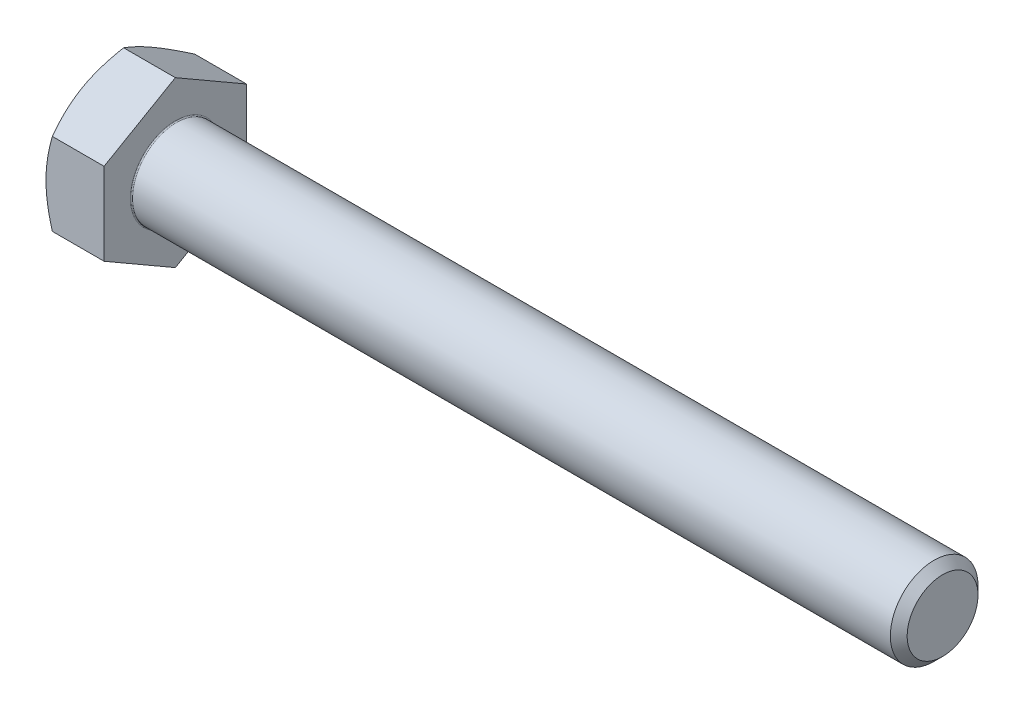
ISO-10303-21;
HEADER;
FILE_DESCRIPTION(('STEP AP214'),'2;1');
FILE_NAME('part.step','',(''),(''),'','','');
FILE_SCHEMA(('AUTOMOTIVE_DESIGN { 1 0 10303 214 1 1 1 1 }'));
ENDSEC;
DATA;
#1=APPLICATION_CONTEXT('core data for automotive mechanical design processes');
#2=APPLICATION_PROTOCOL_DEFINITION('international standard','automotive_design',2000,#1);
#3=PRODUCT_CONTEXT('',#1,'mechanical');
#4=PRODUCT('Part','Part','',(#3));
#5=PRODUCT_RELATED_PRODUCT_CATEGORY('part','',(#4));
#6=PRODUCT_DEFINITION_FORMATION('','',#4);
#7=PRODUCT_DEFINITION_CONTEXT('part definition',#1,'design');
#8=PRODUCT_DEFINITION('design','',#6,#7);
#9=PRODUCT_DEFINITION_SHAPE('','',#8);
#10=(LENGTH_UNIT() NAMED_UNIT(*) SI_UNIT(.MILLI.,.METRE.));
#11=(NAMED_UNIT(*) PLANE_ANGLE_UNIT() SI_UNIT($,.RADIAN.));
#12=(NAMED_UNIT(*) SI_UNIT($,.STERADIAN.) SOLID_ANGLE_UNIT());
#13=UNCERTAINTY_MEASURE_WITH_UNIT(LENGTH_MEASURE(1.E-05),#10,'distance_accuracy_value','');
#14=(GEOMETRIC_REPRESENTATION_CONTEXT(3) GLOBAL_UNCERTAINTY_ASSIGNED_CONTEXT((#13)) GLOBAL_UNIT_ASSIGNED_CONTEXT((#10,
#11,#12)) REPRESENTATION_CONTEXT('',''));
#15=CARTESIAN_POINT('',(0.,0.,0.));
#16=DIRECTION('',(0.,0.,1.));
#17=DIRECTION('',(1.,0.,0.));
#18=AXIS2_PLACEMENT_3D('',#15,#16,#17);
#19=CARTESIAN_POINT('',(-5.3,0.,0.));
#20=DIRECTION('',(1.,0.,0.));
#21=DIRECTION('',(0.,1.,0.));
#22=AXIS2_PLACEMENT_3D('',#19,#20,#21);
#23=PLANE('',#22);
#24=CARTESIAN_POINT('',(-5.3,0.,0.));
#25=DIRECTION('',(-1.,0.,0.));
#26=DIRECTION('',(0.,1.,0.));
#27=AXIS2_PLACEMENT_3D('',#24,#25,#26);
#28=CIRCLE('',#27,6.5);
#29=CARTESIAN_POINT('',(-5.3,5.62916512459885,-3.25));
#30=VERTEX_POINT('',#29);
#31=CARTESIAN_POINT('',(-5.3,0.,-6.5));
#32=VERTEX_POINT('',#31);
#33=EDGE_CURVE('E186',#30,#32,#28,.T.);
#34=ORIENTED_EDGE('',*,*,#33,.T.);
#35=CARTESIAN_POINT('',(-5.3,0.,0.));
#36=DIRECTION('',(-1.,0.,0.));
#37=DIRECTION('',(0.,1.,0.));
#38=AXIS2_PLACEMENT_3D('',#35,#36,#37);
#39=CIRCLE('',#38,6.5);
#40=CARTESIAN_POINT('',(-5.3,-5.62916512459885,-3.25));
#41=VERTEX_POINT('',#40);
#42=EDGE_CURVE('E160',#32,#41,#39,.T.);
#43=ORIENTED_EDGE('',*,*,#42,.T.);
#44=CARTESIAN_POINT('',(-5.3,0.,0.));
#45=DIRECTION('',(-1.,0.,0.));
#46=DIRECTION('',(0.,1.,0.));
#47=AXIS2_PLACEMENT_3D('',#44,#45,#46);
#48=CIRCLE('',#47,6.5);
#49=CARTESIAN_POINT('',(-5.3,-5.62916512459885,3.25));
#50=VERTEX_POINT('',#49);
#51=EDGE_CURVE('E145',#41,#50,#48,.T.);
#52=ORIENTED_EDGE('',*,*,#51,.T.);
#53=CARTESIAN_POINT('',(-5.3,0.,0.));
#54=DIRECTION('',(-1.,0.,0.));
#55=DIRECTION('',(0.,1.,0.));
#56=AXIS2_PLACEMENT_3D('',#53,#54,#55);
#57=CIRCLE('',#56,6.5);
#58=CARTESIAN_POINT('',(-5.3,0.,6.5));
#59=VERTEX_POINT('',#58);
#60=EDGE_CURVE('E202',#50,#59,#57,.T.);
#61=ORIENTED_EDGE('',*,*,#60,.T.);
#62=CARTESIAN_POINT('',(-5.3,0.,0.));
#63=DIRECTION('',(-1.,0.,0.));
#64=DIRECTION('',(0.,1.,0.));
#65=AXIS2_PLACEMENT_3D('',#62,#63,#64);
#66=CIRCLE('',#65,6.5);
#67=CARTESIAN_POINT('',(-5.3,5.62916512459885,3.25));
#68=VERTEX_POINT('',#67);
#69=EDGE_CURVE('E175',#59,#68,#66,.T.);
#70=ORIENTED_EDGE('',*,*,#69,.T.);
#71=CARTESIAN_POINT('',(-5.3,0.,0.));
#72=DIRECTION('',(-1.,0.,0.));
#73=DIRECTION('',(0.,1.,0.));
#74=AXIS2_PLACEMENT_3D('',#71,#72,#73);
#75=CIRCLE('',#74,6.5);
#76=EDGE_CURVE('E204',#68,#30,#75,.T.);
#77=ORIENTED_EDGE('',*,*,#76,.T.);
#78=EDGE_LOOP('',(#34,#43,#52,#61,#70,#77));
#79=FACE_BOUND('',#78,.T.);
#80=ADVANCED_FACE('F16',(#79),#23,.F.);
#81=CARTESIAN_POINT('',(0.,7.50555349946513,0.));
#82=DIRECTION('',(0.,0.866025403784438,0.5));
#83=DIRECTION('',(1.,0.,0.));
#84=AXIS2_PLACEMENT_3D('',#81,#82,#83);
#85=PLANE('',#84);
#86=CARTESIAN_POINT('',(-5.3,5.62916512459885,3.25));
#87=CARTESIAN_POINT('',(-5.3,4.7583302491977,4.75833024919769));
#88=CARTESIAN_POINT('',(-4.71944341639924,3.75277674973256,6.5));
#89=(BOUNDED_CURVE() B_SPLINE_CURVE(2,(#86,#87,#88),.UNSPECIFIED.,.F.,
.F.) B_SPLINE_CURVE_WITH_KNOTS((3,3),(0.439000868202294,0.827027033445395),
.UNSPECIFIED.) CURVE() GEOMETRIC_REPRESENTATION_ITEM() RATIONAL_B_SPLINE_CURVE((1.,
1.04314139574018,1.0100187493574)) REPRESENTATION_ITEM(''));
#90=CARTESIAN_POINT('',(-4.71944341639924,3.75277674973256,6.5));
#91=VERTEX_POINT('',#90);
#92=EDGE_CURVE('E169',#68,#91,#89,.T.);
#93=ORIENTED_EDGE('',*,*,#92,.T.);
#94=DIRECTION('',(-1.,0.,0.));
#95=VECTOR('',#94,1.);
#96=CARTESIAN_POINT('',(0.,3.75277674973256,6.5));
#97=LINE('',#96,#95);
#98=CARTESIAN_POINT('',(0.,3.75277674973256,6.5));
#99=VERTEX_POINT('',#98);
#100=EDGE_CURVE('E26',#99,#91,#97,.T.);
#101=ORIENTED_EDGE('',*,*,#100,.F.);
#102=DIRECTION('',(0.,-0.5,0.866025403784438));
#103=VECTOR('',#102,1.);
#104=CARTESIAN_POINT('',(0.,7.50555349946513,0.));
#105=LINE('',#104,#103);
#106=CARTESIAN_POINT('',(0.,7.50555349946513,0.));
#107=VERTEX_POINT('',#106);
#108=EDGE_CURVE('E132',#107,#99,#105,.T.);
#109=ORIENTED_EDGE('',*,*,#108,.F.);
#110=DIRECTION('',(-1.,0.,0.));
#111=VECTOR('',#110,1.);
#112=CARTESIAN_POINT('',(0.,7.50555349946513,0.));
#113=LINE('',#112,#111);
#114=CARTESIAN_POINT('',(-4.71944341639924,7.50555349946513,0.));
#115=VERTEX_POINT('',#114);
#116=EDGE_CURVE('E11',#107,#115,#113,.T.);
#117=ORIENTED_EDGE('',*,*,#116,.T.);
#118=CARTESIAN_POINT('',(-4.71944341639924,7.50555349946513,0.));
#119=CARTESIAN_POINT('',(-5.3,6.5,1.74166975080231));
#120=CARTESIAN_POINT('',(-5.3,5.62916512459885,3.25));
#121=(BOUNDED_CURVE() B_SPLINE_CURVE(2,(#118,#119,#120),.UNSPECIFIED.,.F.,
.F.) B_SPLINE_CURVE_WITH_KNOTS((3,3),(0.050974702959193,0.439000868202294),
.UNSPECIFIED.) CURVE() GEOMETRIC_REPRESENTATION_ITEM() RATIONAL_B_SPLINE_CURVE((1.01001874935741,
1.04314139574019,1.)) REPRESENTATION_ITEM(''));
#122=EDGE_CURVE('E246',#115,#68,#121,.T.);
#123=ORIENTED_EDGE('',*,*,#122,.T.);
#124=EDGE_LOOP('',(#93,#101,#109,#117,#123));
#125=FACE_BOUND('',#124,.T.);
#126=ADVANCED_FACE('F277',(#125),#85,.T.);
#127=CARTESIAN_POINT('',(0.,3.75277674973257,-6.5));
#128=DIRECTION('',(0.,0.866025403784439,-0.5));
#129=DIRECTION('',(-1.,0.,0.));
#130=AXIS2_PLACEMENT_3D('',#127,#128,#129);
#131=PLANE('',#130);
#132=CARTESIAN_POINT('',(-5.3,5.62916512459885,-3.25));
#133=CARTESIAN_POINT('',(-5.3,6.49999999999999,-1.7416697508023));
#134=CARTESIAN_POINT('',(-4.71944341639924,7.50555349946513,0.));
#135=(BOUNDED_CURVE() B_SPLINE_CURVE(2,(#132,#133,#134),.UNSPECIFIED.,.F.,
.F.) B_SPLINE_CURVE_WITH_KNOTS((3,3),(0.439000868202294,0.827027033445395),
.UNSPECIFIED.) CURVE() GEOMETRIC_REPRESENTATION_ITEM() RATIONAL_B_SPLINE_CURVE((1.,
1.04314139574018,1.0100187493574)) REPRESENTATION_ITEM(''));
#136=EDGE_CURVE('E211',#30,#115,#135,.T.);
#137=ORIENTED_EDGE('',*,*,#136,.T.);
#138=ORIENTED_EDGE('',*,*,#116,.F.);
#139=DIRECTION('',(0.,0.5,0.866025403784439));
#140=VECTOR('',#139,1.);
#141=CARTESIAN_POINT('',(0.,3.75277674973257,-6.5));
#142=LINE('',#141,#140);
#143=CARTESIAN_POINT('',(0.,3.75277674973257,-6.5));
#144=VERTEX_POINT('',#143);
#145=EDGE_CURVE('E153',#144,#107,#142,.T.);
#146=ORIENTED_EDGE('',*,*,#145,.F.);
#147=DIRECTION('',(-1.,0.,0.));
#148=VECTOR('',#147,1.);
#149=CARTESIAN_POINT('',(0.,3.75277674973257,-6.5));
#150=LINE('',#149,#148);
#151=CARTESIAN_POINT('',(-4.71944341639924,3.75277674973257,-6.5));
#152=VERTEX_POINT('',#151);
#153=EDGE_CURVE('E38',#144,#152,#150,.T.);
#154=ORIENTED_EDGE('',*,*,#153,.T.);
#155=CARTESIAN_POINT('',(-4.71944341639924,3.75277674973257,-6.49999999999999));
#156=CARTESIAN_POINT('',(-5.3,4.75833024919771,-4.75833024919768));
#157=CARTESIAN_POINT('',(-5.3,5.62916512459885,-3.25));
#158=(BOUNDED_CURVE() B_SPLINE_CURVE(2,(#155,#156,#157),.UNSPECIFIED.,.F.,
.F.) B_SPLINE_CURVE_WITH_KNOTS((3,3),(0.0509747029591937,0.439000868202294),
.UNSPECIFIED.) CURVE() GEOMETRIC_REPRESENTATION_ITEM() RATIONAL_B_SPLINE_CURVE((1.0100187493574,
1.04314139574017,1.)) REPRESENTATION_ITEM(''));
#159=EDGE_CURVE('E195',#152,#30,#158,.T.);
#160=ORIENTED_EDGE('',*,*,#159,.T.);
#161=EDGE_LOOP('',(#137,#138,#146,#154,#160));
#162=FACE_BOUND('',#161,.T.);
#163=ADVANCED_FACE('F332',(#162),#131,.T.);
#164=CARTESIAN_POINT('',(0.,3.75277674973256,6.5));
#165=DIRECTION('',(0.,0.,1.));
#166=DIRECTION('',(0.,-1.,0.));
#167=AXIS2_PLACEMENT_3D('',#164,#165,#166);
#168=PLANE('',#167);
#169=CARTESIAN_POINT('',(-5.3,0.,6.5));
#170=CARTESIAN_POINT('',(-5.3,-1.74166975080229,6.5));
#171=CARTESIAN_POINT('',(-4.71944341639924,-3.75277674973257,6.49999999999999));
#172=(BOUNDED_CURVE() B_SPLINE_CURVE(2,(#169,#170,#171),.UNSPECIFIED.,.F.,
.F.) B_SPLINE_CURVE_WITH_KNOTS((3,3),(0.439000868202295,0.827027033445395),
.UNSPECIFIED.) CURVE() GEOMETRIC_REPRESENTATION_ITEM() RATIONAL_B_SPLINE_CURVE((1.,
1.04314139574018,1.0100187493574)) REPRESENTATION_ITEM(''));
#173=CARTESIAN_POINT('',(-4.71944341639924,-3.75277674973257,6.5));
#174=VERTEX_POINT('',#173);
#175=EDGE_CURVE('E196',#59,#174,#172,.T.);
#176=ORIENTED_EDGE('',*,*,#175,.T.);
#177=DIRECTION('',(-1.,0.,0.));
#178=VECTOR('',#177,1.);
#179=CARTESIAN_POINT('',(0.,-3.75277674973257,6.5));
#180=LINE('',#179,#178);
#181=CARTESIAN_POINT('',(0.,-3.75277674973257,6.5));
#182=VERTEX_POINT('',#181);
#183=EDGE_CURVE('E194',#182,#174,#180,.T.);
#184=ORIENTED_EDGE('',*,*,#183,.F.);
#185=DIRECTION('',(0.,-1.,0.));
#186=VECTOR('',#185,1.);
#187=CARTESIAN_POINT('',(0.,3.75277674973256,6.5));
#188=LINE('',#187,#186);
#189=EDGE_CURVE('E168',#99,#182,#188,.T.);
#190=ORIENTED_EDGE('',*,*,#189,.F.);
#191=ORIENTED_EDGE('',*,*,#100,.T.);
#192=CARTESIAN_POINT('',(-4.71944341639924,3.75277674973256,6.5));
#193=CARTESIAN_POINT('',(-5.3,1.74166975080229,6.50000000000001));
#194=CARTESIAN_POINT('',(-5.3,0.,6.5));
#195=(BOUNDED_CURVE() B_SPLINE_CURVE(2,(#192,#193,#194),.UNSPECIFIED.,.F.,
.F.) B_SPLINE_CURVE_WITH_KNOTS((3,3),(0.0509747029591941,0.439000868202295),
.UNSPECIFIED.) CURVE() GEOMETRIC_REPRESENTATION_ITEM() RATIONAL_B_SPLINE_CURVE((1.01001874935741,
1.04314139574019,1.)) REPRESENTATION_ITEM(''));
#196=EDGE_CURVE('E176',#91,#59,#195,.T.);
#197=ORIENTED_EDGE('',*,*,#196,.T.);
#198=EDGE_LOOP('',(#176,#184,#190,#191,#197));
#199=FACE_BOUND('',#198,.T.);
#200=ADVANCED_FACE('F294',(#199),#168,.T.);
#201=CARTESIAN_POINT('',(0.,-3.75277674973256,-6.5));
#202=DIRECTION('',(0.,0.,-1.));
#203=DIRECTION('',(-1.,0.,0.));
#204=AXIS2_PLACEMENT_3D('',#201,#202,#203);
#205=PLANE('',#204);
#206=CARTESIAN_POINT('',(-4.71944341639924,-3.75277674973256,-6.5));
#207=CARTESIAN_POINT('',(-5.3,-1.74166975080228,-6.50000000000001));
#208=CARTESIAN_POINT('',(-5.3,0.,-6.5));
#209=(BOUNDED_CURVE() B_SPLINE_CURVE(2,(#206,#207,#208),.UNSPECIFIED.,.F.,
.F.) B_SPLINE_CURVE_WITH_KNOTS((3,3),(0.0509747029591942,0.439000868202295),
.UNSPECIFIED.) CURVE() GEOMETRIC_REPRESENTATION_ITEM() RATIONAL_B_SPLINE_CURVE((1.0100187493574,
1.04314139574017,1.)) REPRESENTATION_ITEM(''));
#210=CARTESIAN_POINT('',(-4.71944341639924,-3.75277674973256,-6.5));
#211=VERTEX_POINT('',#210);
#212=EDGE_CURVE('E187',#211,#32,#209,.T.);
#213=ORIENTED_EDGE('',*,*,#212,.T.);
#214=CARTESIAN_POINT('',(-5.3,0.,-6.5));
#215=CARTESIAN_POINT('',(-5.3,1.74166975080229,-6.49999999999999));
#216=CARTESIAN_POINT('',(-4.71944341639924,3.75277674973257,-6.49999999999999));
#217=(BOUNDED_CURVE() B_SPLINE_CURVE(2,(#214,#215,#216),.UNSPECIFIED.,.F.,
.F.) B_SPLINE_CURVE_WITH_KNOTS((3,3),(0.439000868202295,0.827027033445395),
.UNSPECIFIED.) CURVE() GEOMETRIC_REPRESENTATION_ITEM() RATIONAL_B_SPLINE_CURVE((1.,
1.04314139574018,1.0100187493574)) REPRESENTATION_ITEM(''));
#218=EDGE_CURVE('E177',#32,#152,#217,.T.);
#219=ORIENTED_EDGE('',*,*,#218,.T.);
#220=ORIENTED_EDGE('',*,*,#153,.F.);
#221=DIRECTION('',(0.,1.,0.));
#222=VECTOR('',#221,1.);
#223=CARTESIAN_POINT('',(0.,-3.75277674973256,-6.5));
#224=LINE('',#223,#222);
#225=CARTESIAN_POINT('',(0.,-3.75277674973256,-6.5));
#226=VERTEX_POINT('',#225);
#227=EDGE_CURVE('E146',#226,#144,#224,.T.);
#228=ORIENTED_EDGE('',*,*,#227,.F.);
#229=DIRECTION('',(-1.,0.,0.));
#230=VECTOR('',#229,1.);
#231=CARTESIAN_POINT('',(0.,-3.75277674973256,-6.5));
#232=LINE('',#231,#230);
#233=EDGE_CURVE('E303',#226,#211,#232,.T.);
#234=ORIENTED_EDGE('',*,*,#233,.T.);
#235=EDGE_LOOP('',(#213,#219,#220,#228,#234));
#236=FACE_BOUND('',#235,.T.);
#237=ADVANCED_FACE('F338',(#236),#205,.T.);
#238=CARTESIAN_POINT('',(0.,-7.50555349946513,0.));
#239=DIRECTION('',(0.,-0.866025403784439,-0.5));
#240=DIRECTION('',(0.,0.5,-0.866025403784439));
#241=AXIS2_PLACEMENT_3D('',#238,#239,#240);
#242=PLANE('',#241);
#243=CARTESIAN_POINT('',(-4.71944341639924,-7.50555349946513,0.));
#244=CARTESIAN_POINT('',(-5.3,-6.5,-1.74166975080231));
#245=CARTESIAN_POINT('',(-5.3,-5.62916512459885,-3.25));
#246=(BOUNDED_CURVE() B_SPLINE_CURVE(2,(#243,#244,#245),.UNSPECIFIED.,.F.,
.F.) B_SPLINE_CURVE_WITH_KNOTS((3,3),(0.0509747029591947,0.439000868202295),
.UNSPECIFIED.) CURVE() GEOMETRIC_REPRESENTATION_ITEM() RATIONAL_B_SPLINE_CURVE((1.0100187493574,
1.04314139574017,1.)) REPRESENTATION_ITEM(''));
#247=CARTESIAN_POINT('',(-4.71944341639924,-7.50555349946513,0.));
#248=VERTEX_POINT('',#247);
#249=EDGE_CURVE('E138',#248,#41,#246,.T.);
#250=ORIENTED_EDGE('',*,*,#249,.T.);
#251=CARTESIAN_POINT('',(-5.3,-5.62916512459885,-3.25));
#252=CARTESIAN_POINT('',(-5.3,-4.7583302491977,-4.7583302491977));
#253=CARTESIAN_POINT('',(-4.71944341639924,-3.75277674973256,-6.5));
#254=(BOUNDED_CURVE() B_SPLINE_CURVE(2,(#251,#252,#253),.UNSPECIFIED.,.F.,
.F.) B_SPLINE_CURVE_WITH_KNOTS((3,3),(0.439000868202295,0.827027033445396),
.UNSPECIFIED.) CURVE() GEOMETRIC_REPRESENTATION_ITEM() RATIONAL_B_SPLINE_CURVE((1.,
1.04314139574018,1.0100187493574)) REPRESENTATION_ITEM(''));
#255=EDGE_CURVE('E144',#41,#211,#254,.T.);
#256=ORIENTED_EDGE('',*,*,#255,.T.);
#257=ORIENTED_EDGE('',*,*,#233,.F.);
#258=DIRECTION('',(0.,0.5,-0.866025403784438));
#259=VECTOR('',#258,1.);
#260=CARTESIAN_POINT('',(0.,-7.50555349946513,0.));
#261=LINE('',#260,#259);
#262=CARTESIAN_POINT('',(0.,-7.50555349946513,0.));
#263=VERTEX_POINT('',#262);
#264=EDGE_CURVE('E154',#263,#226,#261,.T.);
#265=ORIENTED_EDGE('',*,*,#264,.F.);
#266=DIRECTION('',(-1.,0.,0.));
#267=VECTOR('',#266,1.);
#268=CARTESIAN_POINT('',(0.,-7.50555349946513,0.));
#269=LINE('',#268,#267);
#270=EDGE_CURVE('E188',#263,#248,#269,.T.);
#271=ORIENTED_EDGE('',*,*,#270,.T.);
#272=EDGE_LOOP('',(#250,#256,#257,#265,#271));
#273=FACE_BOUND('',#272,.T.);
#274=ADVANCED_FACE('F354',(#273),#242,.T.);
#275=CARTESIAN_POINT('',(0.,-3.75277674973257,6.5));
#276=DIRECTION('',(0.,-0.866025403784439,0.5));
#277=DIRECTION('',(-1.,0.,0.));
#278=AXIS2_PLACEMENT_3D('',#275,#276,#277);
#279=PLANE('',#278);
#280=CARTESIAN_POINT('',(-4.71944341639924,-3.75277674973257,6.49999999999999));
#281=CARTESIAN_POINT('',(-5.30000000000001,-4.75833024919771,4.75833024919769));
#282=CARTESIAN_POINT('',(-5.3,-5.62916512459885,3.25));
#283=(BOUNDED_CURVE() B_SPLINE_CURVE(2,(#280,#281,#282),.UNSPECIFIED.,.F.,
.F.) B_SPLINE_CURVE_WITH_KNOTS((3,3),(0.0509747029591935,0.439000868202295),
.UNSPECIFIED.) CURVE() GEOMETRIC_REPRESENTATION_ITEM() RATIONAL_B_SPLINE_CURVE((1.01001874935741,
1.04314139574019,1.)) REPRESENTATION_ITEM(''));
#284=EDGE_CURVE('E203',#174,#50,#283,.T.);
#285=ORIENTED_EDGE('',*,*,#284,.T.);
#286=CARTESIAN_POINT('',(-5.3,-5.62916512459885,3.25));
#287=CARTESIAN_POINT('',(-5.30000000000001,-6.49999999999999,1.74166975080231));
#288=CARTESIAN_POINT('',(-4.71944341639924,-7.50555349946513,0.));
#289=(BOUNDED_CURVE() B_SPLINE_CURVE(2,(#286,#287,#288),.UNSPECIFIED.,.F.,
.F.) B_SPLINE_CURVE_WITH_KNOTS((3,3),(0.439000868202295,0.827027033445396),
.UNSPECIFIED.) CURVE() GEOMETRIC_REPRESENTATION_ITEM() RATIONAL_B_SPLINE_CURVE((1.,
1.04314139574018,1.0100187493574)) REPRESENTATION_ITEM(''));
#290=EDGE_CURVE('E212',#50,#248,#289,.T.);
#291=ORIENTED_EDGE('',*,*,#290,.T.);
#292=ORIENTED_EDGE('',*,*,#270,.F.);
#293=DIRECTION('',(0.,-0.5,-0.866025403784439));
#294=VECTOR('',#293,1.);
#295=CARTESIAN_POINT('',(0.,-3.75277674973257,6.5));
#296=LINE('',#295,#294);
#297=EDGE_CURVE('E161',#182,#263,#296,.T.);
#298=ORIENTED_EDGE('',*,*,#297,.F.);
#299=ORIENTED_EDGE('',*,*,#183,.T.);
#300=EDGE_LOOP('',(#285,#291,#292,#298,#299));
#301=FACE_BOUND('',#300,.T.);
#302=ADVANCED_FACE('F350',(#301),#279,.T.);
#303=CARTESIAN_POINT('',(-4.92472232502675,0.,0.));
#304=DIRECTION('',(1.,0.,0.));
#305=DIRECTION('',(0.,1.,0.));
#306=AXIS2_PLACEMENT_3D('',#303,#304,#305);
#307=CONICAL_SURFACE('',#306,7.15,1.0471975512);
#308=ORIENTED_EDGE('',*,*,#218,.F.);
#309=ORIENTED_EDGE('',*,*,#33,.F.);
#310=ORIENTED_EDGE('',*,*,#159,.F.);
#311=EDGE_LOOP('',(#308,#309,#310));
#312=FACE_BOUND('',#311,.T.);
#313=ADVANCED_FACE('F334',(#312),#307,.T.);
#314=CARTESIAN_POINT('',(-4.92472232502675,0.,0.));
#315=DIRECTION('',(1.,0.,0.));
#316=DIRECTION('',(0.,1.,0.));
#317=AXIS2_PLACEMENT_3D('',#314,#315,#316);
#318=CONICAL_SURFACE('',#317,7.15,1.0471975512);
#319=ORIENTED_EDGE('',*,*,#255,.F.);
#320=ORIENTED_EDGE('',*,*,#42,.F.);
#321=ORIENTED_EDGE('',*,*,#212,.F.);
#322=EDGE_LOOP('',(#319,#320,#321));
#323=FACE_BOUND('',#322,.T.);
#324=ADVANCED_FACE('F342',(#323),#318,.T.);
#325=CARTESIAN_POINT('',(-4.92472232502675,0.,0.));
#326=DIRECTION('',(1.,0.,0.));
#327=DIRECTION('',(0.,1.,0.));
#328=AXIS2_PLACEMENT_3D('',#325,#326,#327);
#329=CONICAL_SURFACE('',#328,7.15,1.0471975512);
#330=ORIENTED_EDGE('',*,*,#290,.F.);
#331=ORIENTED_EDGE('',*,*,#51,.F.);
#332=ORIENTED_EDGE('',*,*,#249,.F.);
#333=EDGE_LOOP('',(#330,#331,#332));
#334=FACE_BOUND('',#333,.T.);
#335=ADVANCED_FACE('F347',(#334),#329,.T.);
#336=CARTESIAN_POINT('',(-4.92472232502675,0.,0.));
#337=DIRECTION('',(1.,0.,0.));
#338=DIRECTION('',(0.,1.,0.));
#339=AXIS2_PLACEMENT_3D('',#336,#337,#338);
#340=CONICAL_SURFACE('',#339,7.15,1.0471975512);
#341=ORIENTED_EDGE('',*,*,#284,.F.);
#342=ORIENTED_EDGE('',*,*,#175,.F.);
#343=ORIENTED_EDGE('',*,*,#60,.F.);
#344=EDGE_LOOP('',(#341,#342,#343));
#345=FACE_BOUND('',#344,.T.);
#346=ADVANCED_FACE('F18',(#345),#340,.T.);
#347=CARTESIAN_POINT('',(-4.92472232502675,0.,0.));
#348=DIRECTION('',(1.,0.,0.));
#349=DIRECTION('',(0.,1.,0.));
#350=AXIS2_PLACEMENT_3D('',#347,#348,#349);
#351=CONICAL_SURFACE('',#350,7.15,1.0471975512);
#352=ORIENTED_EDGE('',*,*,#196,.F.);
#353=ORIENTED_EDGE('',*,*,#92,.F.);
#354=ORIENTED_EDGE('',*,*,#69,.F.);
#355=EDGE_LOOP('',(#352,#353,#354));
#356=FACE_BOUND('',#355,.T.);
#357=ADVANCED_FACE('F292',(#356),#351,.T.);
#358=CARTESIAN_POINT('',(-4.92472232502675,0.,0.));
#359=DIRECTION('',(1.,0.,0.));
#360=DIRECTION('',(0.,1.,0.));
#361=AXIS2_PLACEMENT_3D('',#358,#359,#360);
#362=CONICAL_SURFACE('',#361,7.15,1.0471975512);
#363=ORIENTED_EDGE('',*,*,#122,.F.);
#364=ORIENTED_EDGE('',*,*,#136,.F.);
#365=ORIENTED_EDGE('',*,*,#76,.F.);
#366=EDGE_LOOP('',(#363,#364,#365));
#367=FACE_BOUND('',#366,.T.);
#368=ADVANCED_FACE('F284',(#367),#362,.T.);
#369=CARTESIAN_POINT('',(70.,2.,0.));
#370=DIRECTION('',(1.,0.,0.));
#371=DIRECTION('',(0.,1.,0.));
#372=AXIS2_PLACEMENT_3D('',#369,#370,#371);
#373=PLANE('',#372);
#374=CARTESIAN_POINT('',(70.,0.,0.));
#375=DIRECTION('',(-1.,0.,0.));
#376=DIRECTION('',(0.,-1.,0.));
#377=AXIS2_PLACEMENT_3D('',#374,#375,#376);
#378=CIRCLE('',#377,3.23318750000001);
#379=CARTESIAN_POINT('',(70.,3.23318750000001,0.));
#380=VERTEX_POINT('',#379);
#381=EDGE_CURVE('E224',#380,#380,#378,.T.);
#382=ORIENTED_EDGE('',*,*,#381,.F.);
#383=EDGE_LOOP('',(#382));
#384=FACE_BOUND('',#383,.T.);
#385=ADVANCED_FACE('F376',(#384),#373,.T.);
#386=CARTESIAN_POINT('',(69.61654375,0.,0.));
#387=DIRECTION('',(-1.,0.,0.));
#388=DIRECTION('',(0.,-1.,0.));
#389=AXIS2_PLACEMENT_3D('',#386,#387,#388);
#390=CONICAL_SURFACE('',#389,3.61659375,0.785332962663323);
#391=ORIENTED_EDGE('',*,*,#381,.T.);
#392=EDGE_LOOP('',(#391));
#393=FACE_BOUND('',#392,.T.);
#394=CARTESIAN_POINT('',(69.2330875,0.,0.));
#395=DIRECTION('',(1.,0.,0.));
#396=DIRECTION('',(0.,-1.,0.));
#397=AXIS2_PLACEMENT_3D('',#394,#395,#396);
#398=CIRCLE('',#397,4.);
#399=CARTESIAN_POINT('',(69.2330875,4.,0.));
#400=VERTEX_POINT('',#399);
#401=EDGE_CURVE('E124',#400,#400,#398,.T.);
#402=ORIENTED_EDGE('',*,*,#401,.T.);
#403=EDGE_LOOP('',(#402));
#404=FACE_BOUND('',#403,.T.);
#405=ADVANCED_FACE('F379',(#393,#404),#390,.T.);
#406=CARTESIAN_POINT('',(0.,0.,0.));
#407=DIRECTION('',(1.,0.,0.));
#408=DIRECTION('',(0.,1.,0.));
#409=AXIS2_PLACEMENT_3D('',#406,#407,#408);
#410=PLANE('',#409);
#411=CARTESIAN_POINT('',(0.,0.,0.));
#412=DIRECTION('',(1.,0.,0.));
#413=DIRECTION('',(0.,-1.,0.));
#414=AXIS2_PLACEMENT_3D('',#411,#412,#413);
#415=CIRCLE('',#414,4.1);
#416=CARTESIAN_POINT('',(0.,4.1,0.));
#417=VERTEX_POINT('',#416);
#418=EDGE_CURVE('E125',#417,#417,#415,.T.);
#419=ORIENTED_EDGE('',*,*,#418,.F.);
#420=EDGE_LOOP('',(#419));
#421=FACE_BOUND('',#420,.T.);
#422=ORIENTED_EDGE('',*,*,#108,.T.);
#423=ORIENTED_EDGE('',*,*,#189,.T.);
#424=ORIENTED_EDGE('',*,*,#297,.T.);
#425=ORIENTED_EDGE('',*,*,#264,.T.);
#426=ORIENTED_EDGE('',*,*,#227,.T.);
#427=ORIENTED_EDGE('',*,*,#145,.T.);
#428=EDGE_LOOP('',(#422,#423,#424,#425,#426,#427));
#429=FACE_BOUND('',#428,.T.);
#430=ADVANCED_FACE('F330',(#421,#429),#410,.T.);
#431=CARTESIAN_POINT('',(35.,0.,0.));
#432=DIRECTION('',(1.,0.,0.));
#433=DIRECTION('',(0.,1.,0.));
#434=AXIS2_PLACEMENT_3D('',#431,#432,#433);
#435=CYLINDRICAL_SURFACE('',#434,4.);
#436=CARTESIAN_POINT('',(0.0999999999999979,0.,0.));
#437=DIRECTION('',(-1.,0.,0.));
#438=DIRECTION('',(0.,-1.,0.));
#439=AXIS2_PLACEMENT_3D('',#436,#437,#438);
#440=CIRCLE('',#439,4.);
#441=CARTESIAN_POINT('',(0.0999999999999975,4.,0.));
#442=VERTEX_POINT('',#441);
#443=EDGE_CURVE('E119',#442,#442,#440,.T.);
#444=ORIENTED_EDGE('',*,*,#443,.F.);
#445=EDGE_LOOP('',(#444));
#446=FACE_BOUND('',#445,.T.);
#447=ORIENTED_EDGE('',*,*,#401,.F.);
#448=EDGE_LOOP('',(#447));
#449=FACE_BOUND('',#448,.T.);
#450=ADVANCED_FACE('F373',(#446,#449),#435,.T.);
#451=CARTESIAN_POINT('',(0.0999999999999979,0.,0.));
#452=DIRECTION('',(1.,0.,0.));
#453=DIRECTION('',(0.,0.,-1.));
#454=AXIS2_PLACEMENT_3D('',#451,#452,#453);
#455=TOROIDAL_SURFACE('',#454,4.1,0.1);
#456=ORIENTED_EDGE('',*,*,#443,.T.);
#457=EDGE_LOOP('',(#456));
#458=FACE_BOUND('',#457,.T.);
#459=ORIENTED_EDGE('',*,*,#418,.T.);
#460=EDGE_LOOP('',(#459));
#461=FACE_BOUND('',#460,.T.);
#462=ADVANCED_FACE('F120',(#458,#461),#455,.F.);
#463=CLOSED_SHELL('',(#80,#126,#163,#200,#237,#274,#302,#313,#324,#335,#346,#357,#368,#385,#405,
#430,#450,#462));
#464=MANIFOLD_SOLID_BREP('B1',#463);
#465=ADVANCED_BREP_SHAPE_REPRESENTATION('',(#18,#464),#14);
#466=SHAPE_DEFINITION_REPRESENTATION(#9,#465);
ENDSEC;
END-ISO-10303-21;
